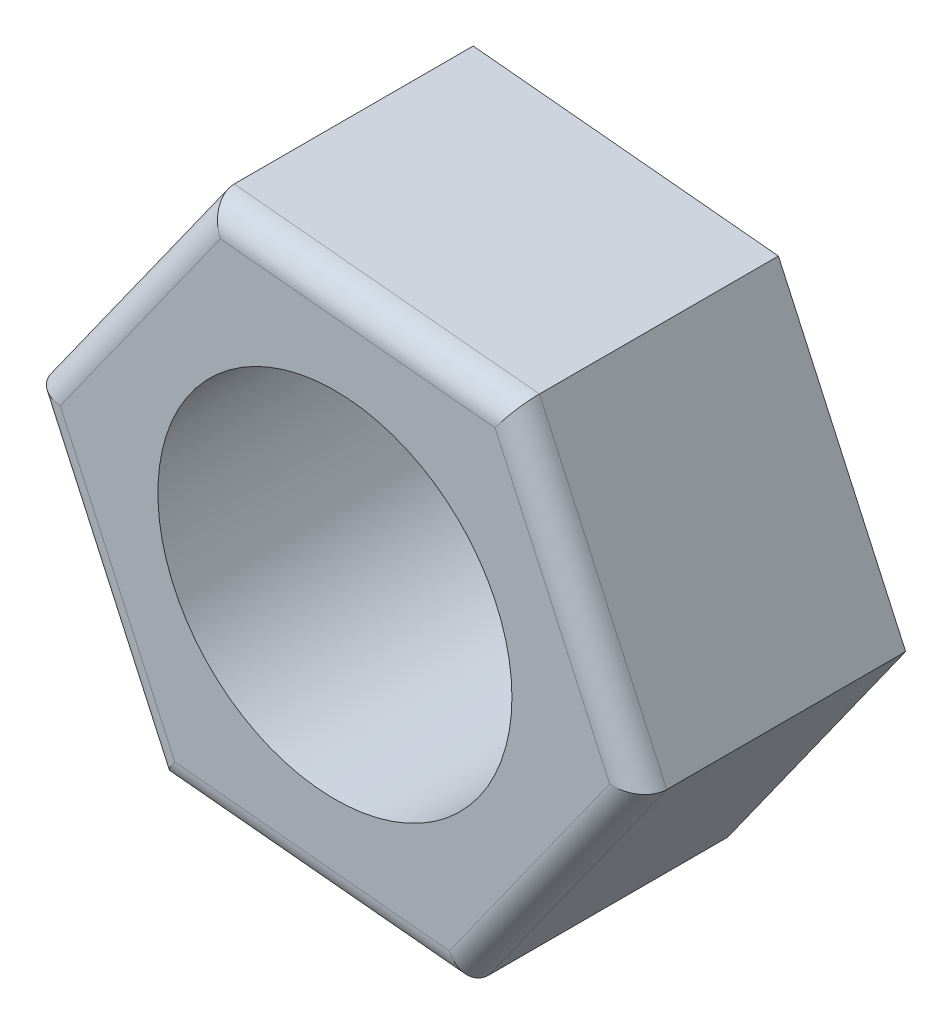
ISO-10303-21;
HEADER;
FILE_DESCRIPTION(('STEP AP214'),'2;1');
FILE_NAME('part.step','',(''),(''),'','','');
FILE_SCHEMA(('AUTOMOTIVE_DESIGN { 1 0 10303 214 1 1 1 1 }'));
ENDSEC;
DATA;
#1=APPLICATION_CONTEXT('core data for automotive mechanical design processes');
#2=APPLICATION_PROTOCOL_DEFINITION('international standard','automotive_design',2000,#1);
#3=PRODUCT_CONTEXT('',#1,'mechanical');
#4=PRODUCT('Part','Part','',(#3));
#5=PRODUCT_RELATED_PRODUCT_CATEGORY('part','',(#4));
#6=PRODUCT_DEFINITION_FORMATION('','',#4);
#7=PRODUCT_DEFINITION_CONTEXT('part definition',#1,'design');
#8=PRODUCT_DEFINITION('design','',#6,#7);
#9=PRODUCT_DEFINITION_SHAPE('','',#8);
#10=(LENGTH_UNIT() NAMED_UNIT(*) SI_UNIT(.MILLI.,.METRE.));
#11=(NAMED_UNIT(*) PLANE_ANGLE_UNIT() SI_UNIT($,.RADIAN.));
#12=(NAMED_UNIT(*) SI_UNIT($,.STERADIAN.) SOLID_ANGLE_UNIT());
#13=UNCERTAINTY_MEASURE_WITH_UNIT(LENGTH_MEASURE(1.E-05),#10,'distance_accuracy_value','');
#14=(GEOMETRIC_REPRESENTATION_CONTEXT(3) GLOBAL_UNCERTAINTY_ASSIGNED_CONTEXT((#13)) GLOBAL_UNIT_ASSIGNED_CONTEXT((#10,
#11,#12)) REPRESENTATION_CONTEXT('',''));
#15=CARTESIAN_POINT('',(0.,0.,0.));
#16=DIRECTION('',(0.,0.,1.));
#17=DIRECTION('',(1.,0.,0.));
#18=AXIS2_PLACEMENT_3D('',#15,#16,#17);
#19=CARTESIAN_POINT('',(1.437729481273,-3.15165574558493,3.));
#20=DIRECTION('',(0.,0.,1.));
#21=DIRECTION('',(1.,0.,0.));
#22=AXIS2_PLACEMENT_3D('',#19,#20,#21);
#23=PLANE('',#22);
#24=DIRECTION('',(0.415036751517414,-0.909804646553244,0.));
#25=VECTOR('',#24,1.);
#26=CARTESIAN_POINT('',(-1.73760780505726,-2.69642710188948,3.));
#27=LINE('',#26,#25);
#28=CARTESIAN_POINT('',(-3.10345081226661,0.2976458564162,3.));
#29=VERTEX_POINT('',#28);
#30=CARTESIAN_POINT('',(-1.80949427912091,-2.53884431461023,3.));
#31=VERTEX_POINT('',#30);
#32=EDGE_CURVE('E161',#29,#31,#27,.T.);
#33=ORIENTED_EDGE('',*,*,#32,.T.);
#34=DIRECTION('',(0.995432312154938,-0.0954699529583722,0.));
#35=VECTOR('',#34,1.);
#36=CARTESIAN_POINT('',(1.46637046716051,-2.85302605193845,3.));
#37=LINE('',#36,#35);
#38=CARTESIAN_POINT('',(1.2939565331457,-2.83649017102643,3.));
#39=VERTEX_POINT('',#38);
#40=EDGE_CURVE('E163',#31,#39,#37,.T.);
#41=ORIENTED_EDGE('',*,*,#40,.T.);
#42=DIRECTION('',(0.580395560637525,0.814334693594872,0.));
#43=VECTOR('',#42,1.);
#44=CARTESIAN_POINT('',(3.20397827221777,-0.156598950048964,3.));
#45=LINE('',#44,#43);
#46=CARTESIAN_POINT('',(3.10345081226661,-0.2976458564162,3.));
#47=VERTEX_POINT('',#46);
#48=EDGE_CURVE('E113',#39,#47,#45,.T.);
#49=ORIENTED_EDGE('',*,*,#48,.T.);
#50=DIRECTION('',(-0.415036751517414,0.909804646553244,0.));
#51=VECTOR('',#50,1.);
#52=CARTESIAN_POINT('',(1.73760780505726,2.69642710188948,3.));
#53=LINE('',#52,#51);
#54=CARTESIAN_POINT('',(1.80949427912091,2.53884431461024,3.));
#55=VERTEX_POINT('',#54);
#56=EDGE_CURVE('E155',#47,#55,#53,.T.);
#57=ORIENTED_EDGE('',*,*,#56,.T.);
#58=DIRECTION('',(-0.995432312154938,0.0954699529583721,0.));
#59=VECTOR('',#58,1.);
#60=CARTESIAN_POINT('',(-1.46637046716051,2.85302605193845,3.));
#61=LINE('',#60,#59);
#62=CARTESIAN_POINT('',(-1.2939565331457,2.83649017102643,3.));
#63=VERTEX_POINT('',#62);
#64=EDGE_CURVE('E157',#55,#63,#61,.T.);
#65=ORIENTED_EDGE('',*,*,#64,.T.);
#66=DIRECTION('',(-0.580395560637525,-0.814334693594872,0.));
#67=VECTOR('',#66,1.);
#68=CARTESIAN_POINT('',(-3.20397827221777,0.156598950048965,3.));
#69=LINE('',#68,#67);
#70=EDGE_CURVE('E159',#63,#29,#69,.T.);
#71=ORIENTED_EDGE('',*,*,#70,.T.);
#72=EDGE_LOOP('',(#33,#41,#49,#57,#65,#71));
#73=FACE_BOUND('',#72,.T.);
#74=CARTESIAN_POINT('',(0.,0.,3.));
#75=DIRECTION('',(0.,0.,1.));
#76=DIRECTION('',(1.,0.,0.));
#77=AXIS2_PLACEMENT_3D('',#74,#75,#76);
#78=CIRCLE('',#77,2.);
#79=CARTESIAN_POINT('',(2.,0.,3.));
#80=VERTEX_POINT('',#79);
#81=EDGE_CURVE('E130',#80,#80,#78,.T.);
#82=ORIENTED_EDGE('',*,*,#81,.F.);
#83=EDGE_LOOP('',(#82));
#84=FACE_BOUND('',#83,.T.);
#85=ADVANCED_FACE('F31',(#73,#84),#23,.T.);
#86=CARTESIAN_POINT('',(1.437729481273,-3.15165574558493,0.));
#87=DIRECTION('',(0.,0.,1.));
#88=DIRECTION('',(1.,0.,0.));
#89=AXIS2_PLACEMENT_3D('',#86,#87,#88);
#90=PLANE('',#89);
#91=DIRECTION('',(0.995432312154938,-0.0954699529583721,0.));
#92=VECTOR('',#91,1.);
#93=CARTESIAN_POINT('',(-2.01054919902323,-2.8209381273447,0.));
#94=LINE('',#93,#92);
#95=CARTESIAN_POINT('',(-2.01054919902323,-2.8209381273447,0.));
#96=VERTEX_POINT('',#95);
#97=CARTESIAN_POINT('',(1.437729481273,-3.15165574558493,0.));
#98=VERTEX_POINT('',#97);
#99=EDGE_CURVE('E121',#96,#98,#94,.T.);
#100=ORIENTED_EDGE('',*,*,#99,.F.);
#101=DIRECTION('',(0.415036751517414,-0.909804646553244,0.));
#102=VECTOR('',#101,1.);
#103=CARTESIAN_POINT('',(-3.44827868029623,0.330717618240222,0.));
#104=LINE('',#103,#102);
#105=CARTESIAN_POINT('',(-3.44827868029623,0.330717618240222,0.));
#106=VERTEX_POINT('',#105);
#107=EDGE_CURVE('E144',#106,#96,#104,.T.);
#108=ORIENTED_EDGE('',*,*,#107,.F.);
#109=DIRECTION('',(-0.580395560637525,-0.814334693594872,0.));
#110=VECTOR('',#109,1.);
#111=CARTESIAN_POINT('',(-1.437729481273,3.15165574558493,0.));
#112=LINE('',#111,#110);
#113=CARTESIAN_POINT('',(-1.437729481273,3.15165574558493,0.));
#114=VERTEX_POINT('',#113);
#115=EDGE_CURVE('E141',#114,#106,#112,.T.);
#116=ORIENTED_EDGE('',*,*,#115,.F.);
#117=DIRECTION('',(-0.995432312154938,0.095469952958372,0.));
#118=VECTOR('',#117,1.);
#119=CARTESIAN_POINT('',(2.01054919902323,2.8209381273447,0.));
#120=LINE('',#119,#118);
#121=CARTESIAN_POINT('',(2.01054919902323,2.8209381273447,0.));
#122=VERTEX_POINT('',#121);
#123=EDGE_CURVE('E138',#122,#114,#120,.T.);
#124=ORIENTED_EDGE('',*,*,#123,.F.);
#125=DIRECTION('',(-0.415036751517414,0.909804646553244,0.));
#126=VECTOR('',#125,1.);
#127=CARTESIAN_POINT('',(3.44827868029623,-0.330717618240222,0.));
#128=LINE('',#127,#126);
#129=CARTESIAN_POINT('',(3.44827868029623,-0.330717618240222,0.));
#130=VERTEX_POINT('',#129);
#131=EDGE_CURVE('E124',#130,#122,#128,.T.);
#132=ORIENTED_EDGE('',*,*,#131,.F.);
#133=DIRECTION('',(0.580395560637525,0.814334693594872,0.));
#134=VECTOR('',#133,1.);
#135=CARTESIAN_POINT('',(1.437729481273,-3.15165574558493,0.));
#136=LINE('',#135,#134);
#137=EDGE_CURVE('E106',#98,#130,#136,.T.);
#138=ORIENTED_EDGE('',*,*,#137,.F.);
#139=EDGE_LOOP('',(#100,#108,#116,#124,#132,#138));
#140=FACE_BOUND('',#139,.T.);
#141=CARTESIAN_POINT('',(0.,0.,0.));
#142=DIRECTION('',(0.,0.,1.));
#143=DIRECTION('',(1.,0.,0.));
#144=AXIS2_PLACEMENT_3D('',#141,#142,#143);
#145=CIRCLE('',#144,2.);
#146=CARTESIAN_POINT('',(2.,0.,0.));
#147=VERTEX_POINT('',#146);
#148=EDGE_CURVE('E133',#147,#147,#145,.T.);
#149=ORIENTED_EDGE('',*,*,#148,.T.);
#150=EDGE_LOOP('',(#149));
#151=FACE_BOUND('',#150,.T.);
#152=ADVANCED_FACE('F118',(#140,#151),#90,.F.);
#153=CARTESIAN_POINT('',(-2.01054919902323,-2.8209381273447,3.));
#154=DIRECTION('',(0.0954699529583722,0.995432312154938,0.));
#155=DIRECTION('',(-0.995432312154938,0.0954699529583722,0.));
#156=AXIS2_PLACEMENT_3D('',#153,#154,#155);
#157=PLANE('',#156);
#158=DIRECTION('',(0.,0.,-1.));
#159=VECTOR('',#158,1.);
#160=CARTESIAN_POINT('',(1.437729481273,-3.15165574558493,3.));
#161=LINE('',#160,#159);
#162=CARTESIAN_POINT('',(1.437729481273,-3.15165574558493,2.7));
#163=VERTEX_POINT('',#162);
#164=EDGE_CURVE('E103',#163,#98,#161,.T.);
#165=ORIENTED_EDGE('',*,*,#164,.F.);
#166=DIRECTION('',(0.995432312154938,-0.0954699529583722,0.));
#167=VECTOR('',#166,1.);
#168=CARTESIAN_POINT('',(-2.01054919902323,-2.8209381273447,2.7));
#169=LINE('',#168,#167);
#170=CARTESIAN_POINT('',(-2.01054919902323,-2.8209381273447,2.7));
#171=VERTEX_POINT('',#170);
#172=EDGE_CURVE('E166',#163,#171,#169,.F.);
#173=ORIENTED_EDGE('',*,*,#172,.T.);
#174=DIRECTION('',(0.,0.,-1.));
#175=VECTOR('',#174,1.);
#176=CARTESIAN_POINT('',(-2.01054919902323,-2.8209381273447,3.));
#177=LINE('',#176,#175);
#178=EDGE_CURVE('E128',#171,#96,#177,.T.);
#179=ORIENTED_EDGE('',*,*,#178,.T.);
#180=ORIENTED_EDGE('',*,*,#99,.T.);
#181=EDGE_LOOP('',(#165,#173,#179,#180));
#182=FACE_BOUND('',#181,.T.);
#183=ADVANCED_FACE('F126',(#182),#157,.F.);
#184=CARTESIAN_POINT('',(1.437729481273,-3.15165574558493,3.));
#185=DIRECTION('',(-0.814334693594872,0.580395560637524,0.));
#186=DIRECTION('',(-0.580395560637525,-0.814334693594872,0.));
#187=AXIS2_PLACEMENT_3D('',#184,#185,#186);
#188=PLANE('',#187);
#189=DIRECTION('',(0.,0.,-1.));
#190=VECTOR('',#189,1.);
#191=CARTESIAN_POINT('',(3.44827868029623,-0.330717618240222,3.));
#192=LINE('',#191,#190);
#193=CARTESIAN_POINT('',(3.44827868029623,-0.330717618240222,2.7));
#194=VERTEX_POINT('',#193);
#195=EDGE_CURVE('E114',#194,#130,#192,.T.);
#196=ORIENTED_EDGE('',*,*,#195,.F.);
#197=DIRECTION('',(0.580395560637525,0.814334693594872,0.));
#198=VECTOR('',#197,1.);
#199=CARTESIAN_POINT('',(1.437729481273,-3.15165574558493,2.7));
#200=LINE('',#199,#198);
#201=EDGE_CURVE('E11',#194,#163,#200,.F.);
#202=ORIENTED_EDGE('',*,*,#201,.T.);
#203=ORIENTED_EDGE('',*,*,#164,.T.);
#204=ORIENTED_EDGE('',*,*,#137,.T.);
#205=EDGE_LOOP('',(#196,#202,#203,#204));
#206=FACE_BOUND('',#205,.T.);
#207=ADVANCED_FACE('F105',(#206),#188,.F.);
#208=CARTESIAN_POINT('',(3.44827868029623,-0.330717618240222,3.));
#209=DIRECTION('',(-0.909804646553244,-0.415036751517414,0.));
#210=DIRECTION('',(0.415036751517414,-0.909804646553244,0.));
#211=AXIS2_PLACEMENT_3D('',#208,#209,#210);
#212=PLANE('',#211);
#213=DIRECTION('',(0.,0.,-1.));
#214=VECTOR('',#213,1.);
#215=CARTESIAN_POINT('',(2.01054919902323,2.8209381273447,3.));
#216=LINE('',#215,#214);
#217=CARTESIAN_POINT('',(2.01054919902323,2.8209381273447,2.7));
#218=VERTEX_POINT('',#217);
#219=EDGE_CURVE('E151',#218,#122,#216,.T.);
#220=ORIENTED_EDGE('',*,*,#219,.F.);
#221=DIRECTION('',(-0.415036751517414,0.909804646553244,0.));
#222=VECTOR('',#221,1.);
#223=CARTESIAN_POINT('',(3.44827868029623,-0.330717618240222,2.7));
#224=LINE('',#223,#222);
#225=EDGE_CURVE('E40',#218,#194,#224,.F.);
#226=ORIENTED_EDGE('',*,*,#225,.T.);
#227=ORIENTED_EDGE('',*,*,#195,.T.);
#228=ORIENTED_EDGE('',*,*,#131,.T.);
#229=EDGE_LOOP('',(#220,#226,#227,#228));
#230=FACE_BOUND('',#229,.T.);
#231=ADVANCED_FACE('F225',(#230),#212,.F.);
#232=CARTESIAN_POINT('',(2.01054919902323,2.8209381273447,3.));
#233=DIRECTION('',(-0.095469952958372,-0.995432312154938,0.));
#234=DIRECTION('',(0.995432312154938,-0.0954699529583721,0.));
#235=AXIS2_PLACEMENT_3D('',#232,#233,#234);
#236=PLANE('',#235);
#237=DIRECTION('',(0.,0.,-1.));
#238=VECTOR('',#237,1.);
#239=CARTESIAN_POINT('',(-1.437729481273,3.15165574558493,3.));
#240=LINE('',#239,#238);
#241=CARTESIAN_POINT('',(-1.437729481273,3.15165574558493,2.7));
#242=VERTEX_POINT('',#241);
#243=EDGE_CURVE('E149',#242,#114,#240,.T.);
#244=ORIENTED_EDGE('',*,*,#243,.F.);
#245=DIRECTION('',(-0.995432312154938,0.0954699529583721,0.));
#246=VECTOR('',#245,1.);
#247=CARTESIAN_POINT('',(2.01054919902323,2.8209381273447,2.7));
#248=LINE('',#247,#246);
#249=EDGE_CURVE('E55',#242,#218,#248,.F.);
#250=ORIENTED_EDGE('',*,*,#249,.T.);
#251=ORIENTED_EDGE('',*,*,#219,.T.);
#252=ORIENTED_EDGE('',*,*,#123,.T.);
#253=EDGE_LOOP('',(#244,#250,#251,#252));
#254=FACE_BOUND('',#253,.T.);
#255=ADVANCED_FACE('F221',(#254),#236,.F.);
#256=CARTESIAN_POINT('',(-1.437729481273,3.15165574558493,3.));
#257=DIRECTION('',(0.814334693594872,-0.580395560637525,0.));
#258=DIRECTION('',(0.580395560637525,0.814334693594872,0.));
#259=AXIS2_PLACEMENT_3D('',#256,#257,#258);
#260=PLANE('',#259);
#261=DIRECTION('',(0.,0.,-1.));
#262=VECTOR('',#261,1.);
#263=CARTESIAN_POINT('',(-3.44827868029623,0.330717618240222,3.));
#264=LINE('',#263,#262);
#265=CARTESIAN_POINT('',(-3.44827868029623,0.330717618240222,2.7));
#266=VERTEX_POINT('',#265);
#267=EDGE_CURVE('E147',#266,#106,#264,.T.);
#268=ORIENTED_EDGE('',*,*,#267,.F.);
#269=DIRECTION('',(-0.580395560637525,-0.814334693594872,0.));
#270=VECTOR('',#269,1.);
#271=CARTESIAN_POINT('',(-1.437729481273,3.15165574558493,2.7));
#272=LINE('',#271,#270);
#273=EDGE_CURVE('E170',#266,#242,#272,.F.);
#274=ORIENTED_EDGE('',*,*,#273,.T.);
#275=ORIENTED_EDGE('',*,*,#243,.T.);
#276=ORIENTED_EDGE('',*,*,#115,.T.);
#277=EDGE_LOOP('',(#268,#274,#275,#276));
#278=FACE_BOUND('',#277,.T.);
#279=ADVANCED_FACE('F207',(#278),#260,.F.);
#280=CARTESIAN_POINT('',(-3.44827868029623,0.330717618240222,3.));
#281=DIRECTION('',(0.909804646553244,0.415036751517413,0.));
#282=DIRECTION('',(-0.415036751517414,0.909804646553244,0.));
#283=AXIS2_PLACEMENT_3D('',#280,#281,#282);
#284=PLANE('',#283);
#285=ORIENTED_EDGE('',*,*,#178,.F.);
#286=DIRECTION('',(0.415036751517414,-0.909804646553244,0.));
#287=VECTOR('',#286,1.);
#288=CARTESIAN_POINT('',(-3.44827868029623,0.330717618240222,2.7));
#289=LINE('',#288,#287);
#290=EDGE_CURVE('E168',#171,#266,#289,.F.);
#291=ORIENTED_EDGE('',*,*,#290,.T.);
#292=ORIENTED_EDGE('',*,*,#267,.T.);
#293=ORIENTED_EDGE('',*,*,#107,.T.);
#294=EDGE_LOOP('',(#285,#291,#292,#293));
#295=FACE_BOUND('',#294,.T.);
#296=ADVANCED_FACE('F198',(#295),#284,.F.);
#297=CARTESIAN_POINT('',(0.,0.,3.));
#298=DIRECTION('',(0.,0.,-1.));
#299=DIRECTION('',(-1.,0.,0.));
#300=AXIS2_PLACEMENT_3D('',#297,#298,#299);
#301=CYLINDRICAL_SURFACE('',#300,2.);
#302=ORIENTED_EDGE('',*,*,#81,.T.);
#303=EDGE_LOOP('',(#302));
#304=FACE_BOUND('',#303,.T.);
#305=ORIENTED_EDGE('',*,*,#148,.F.);
#306=EDGE_LOOP('',(#305));
#307=FACE_BOUND('',#306,.T.);
#308=ADVANCED_FACE('F196',(#304,#307),#301,.F.);
#309=CARTESIAN_POINT('',(1.98190821313572,2.52230843369822,2.7));
#310=DIRECTION('',(0.995432312154938,-0.0954699529583721,0.));
#311=DIRECTION('',(0.0954699529583721,0.995432312154938,0.));
#312=AXIS2_PLACEMENT_3D('',#309,#310,#311);
#313=CYLINDRICAL_SURFACE('',#312,0.3);
#314=CARTESIAN_POINT('',(1.80949427912091,2.53884431461023,2.7));
#315=DIRECTION('',(0.814334693594872,-0.580395560637525,0.));
#316=DIRECTION('',(-0.580395560637525,-0.814334693594872,0.));
#317=AXIS2_PLACEMENT_3D('',#314,#315,#316);
#318=ELLIPSE('',#317,0.346410161513775,0.3);
#319=EDGE_CURVE('E183',#218,#55,#318,.T.);
#320=ORIENTED_EDGE('',*,*,#319,.F.);
#321=ORIENTED_EDGE('',*,*,#249,.F.);
#322=CARTESIAN_POINT('',(-1.2939565331457,2.83649017102644,2.7));
#323=DIRECTION('',(0.909804646553244,0.415036751517414,0.));
#324=DIRECTION('',(0.415036751517414,-0.909804646553244,0.));
#325=AXIS2_PLACEMENT_3D('',#322,#323,#324);
#326=ELLIPSE('',#325,0.346410161513775,0.3);
#327=EDGE_CURVE('E35',#63,#242,#326,.F.);
#328=ORIENTED_EDGE('',*,*,#327,.F.);
#329=ORIENTED_EDGE('',*,*,#64,.F.);
#330=EDGE_LOOP('',(#320,#321,#328,#329));
#331=FACE_BOUND('',#330,.T.);
#332=ADVANCED_FACE('F33',(#331),#313,.T.);
#333=CARTESIAN_POINT('',(-3.20397827221777,0.156598950048964,2.7));
#334=DIRECTION('',(0.580395560637525,0.814334693594872,0.));
#335=DIRECTION('',(-0.814334693594872,0.580395560637525,0.));
#336=AXIS2_PLACEMENT_3D('',#333,#334,#335);
#337=CYLINDRICAL_SURFACE('',#336,0.3);
#338=ORIENTED_EDGE('',*,*,#327,.T.);
#339=ORIENTED_EDGE('',*,*,#273,.F.);
#340=CARTESIAN_POINT('',(-3.10345081226661,0.297645856416201,2.7));
#341=DIRECTION('',(0.0954699529583721,0.995432312154938,0.));
#342=DIRECTION('',(0.995432312154938,-0.0954699529583721,0.));
#343=AXIS2_PLACEMENT_3D('',#340,#341,#342);
#344=ELLIPSE('',#343,0.346410161513775,0.3);
#345=EDGE_CURVE('E181',#29,#266,#344,.F.);
#346=ORIENTED_EDGE('',*,*,#345,.F.);
#347=ORIENTED_EDGE('',*,*,#70,.F.);
#348=EDGE_LOOP('',(#338,#339,#346,#347));
#349=FACE_BOUND('',#348,.T.);
#350=ADVANCED_FACE('F205',(#349),#337,.T.);
#351=CARTESIAN_POINT('',(3.89420202696676,-2.03105651648791,2.7));
#352=DIRECTION('',(0.415036751517414,-0.909804646553244,0.));
#353=DIRECTION('',(0.909804646553244,0.415036751517414,0.));
#354=AXIS2_PLACEMENT_3D('',#351,#352,#353);
#355=CYLINDRICAL_SURFACE('',#354,0.3);
#356=ORIENTED_EDGE('',*,*,#319,.T.);
#357=ORIENTED_EDGE('',*,*,#56,.F.);
#358=CARTESIAN_POINT('',(3.10345081226661,-0.297645856416199,2.7));
#359=DIRECTION('',(-0.095469952958372,-0.995432312154938,0.));
#360=DIRECTION('',(-0.995432312154938,0.0954699529583718,0.));
#361=AXIS2_PLACEMENT_3D('',#358,#359,#360);
#362=ELLIPSE('',#361,0.346410161513775,0.3);
#363=EDGE_CURVE('E178',#194,#47,#362,.T.);
#364=ORIENTED_EDGE('',*,*,#363,.F.);
#365=ORIENTED_EDGE('',*,*,#225,.F.);
#366=EDGE_LOOP('',(#356,#357,#364,#365));
#367=FACE_BOUND('',#366,.T.);
#368=ADVANCED_FACE('F243',(#367),#355,.T.);
#369=CARTESIAN_POINT('',(-1.01874306442076,-4.27225497468194,2.7));
#370=DIRECTION('',(-0.415036751517414,0.909804646553244,0.));
#371=DIRECTION('',(-0.909804646553244,-0.415036751517414,0.));
#372=AXIS2_PLACEMENT_3D('',#369,#370,#371);
#373=CYLINDRICAL_SURFACE('',#372,0.3);
#374=ORIENTED_EDGE('',*,*,#345,.T.);
#375=ORIENTED_EDGE('',*,*,#290,.F.);
#376=CARTESIAN_POINT('',(-1.80949427912091,-2.53884431461023,2.7));
#377=DIRECTION('',(-0.814334693594872,0.580395560637525,0.));
#378=DIRECTION('',(0.580395560637525,0.814334693594872,0.));
#379=AXIS2_PLACEMENT_3D('',#376,#377,#378);
#380=ELLIPSE('',#379,0.346410161513775,0.3);
#381=EDGE_CURVE('E176',#31,#171,#380,.F.);
#382=ORIENTED_EDGE('',*,*,#381,.F.);
#383=ORIENTED_EDGE('',*,*,#32,.F.);
#384=EDGE_LOOP('',(#374,#375,#382,#383));
#385=FACE_BOUND('',#384,.T.);
#386=ADVANCED_FACE('F239',(#385),#373,.T.);
#387=CARTESIAN_POINT('',(1.19342907319454,-2.97753707739367,2.7));
#388=DIRECTION('',(-0.580395560637525,-0.814334693594872,0.));
#389=DIRECTION('',(0.814334693594872,-0.580395560637525,0.));
#390=AXIS2_PLACEMENT_3D('',#387,#388,#389);
#391=CYLINDRICAL_SURFACE('',#390,0.3);
#392=ORIENTED_EDGE('',*,*,#363,.T.);
#393=ORIENTED_EDGE('',*,*,#48,.F.);
#394=CARTESIAN_POINT('',(1.2939565331457,-2.83649017102643,2.7));
#395=DIRECTION('',(-0.909804646553244,-0.415036751517414,0.));
#396=DIRECTION('',(0.415036751517414,-0.909804646553244,0.));
#397=AXIS2_PLACEMENT_3D('',#394,#395,#396);
#398=ELLIPSE('',#397,0.346410161513775,0.3);
#399=EDGE_CURVE('E174',#163,#39,#398,.T.);
#400=ORIENTED_EDGE('',*,*,#399,.F.);
#401=ORIENTED_EDGE('',*,*,#201,.F.);
#402=EDGE_LOOP('',(#392,#393,#400,#401));
#403=FACE_BOUND('',#402,.T.);
#404=ADVANCED_FACE('F235',(#403),#391,.T.);
#405=CARTESIAN_POINT('',(1.46637046716051,-2.85302605193845,2.7));
#406=DIRECTION('',(-0.995432312154938,0.0954699529583722,0.));
#407=DIRECTION('',(-0.0954699529583722,-0.995432312154938,0.));
#408=AXIS2_PLACEMENT_3D('',#405,#406,#407);
#409=CYLINDRICAL_SURFACE('',#408,0.3);
#410=ORIENTED_EDGE('',*,*,#381,.T.);
#411=ORIENTED_EDGE('',*,*,#172,.F.);
#412=ORIENTED_EDGE('',*,*,#399,.T.);
#413=ORIENTED_EDGE('',*,*,#40,.F.);
#414=EDGE_LOOP('',(#410,#411,#412,#413));
#415=FACE_BOUND('',#414,.T.);
#416=ADVANCED_FACE('F232',(#415),#409,.T.);
#417=CLOSED_SHELL('',(#85,#152,#183,#207,#231,#255,#279,#296,#308,#332,#350,#368,#386,#404,#416));
#418=MANIFOLD_SOLID_BREP('B2',#417);
#419=ADVANCED_BREP_SHAPE_REPRESENTATION('',(#18,#418),#14);
#420=SHAPE_DEFINITION_REPRESENTATION(#9,#419);
ENDSEC;
END-ISO-10303-21;
